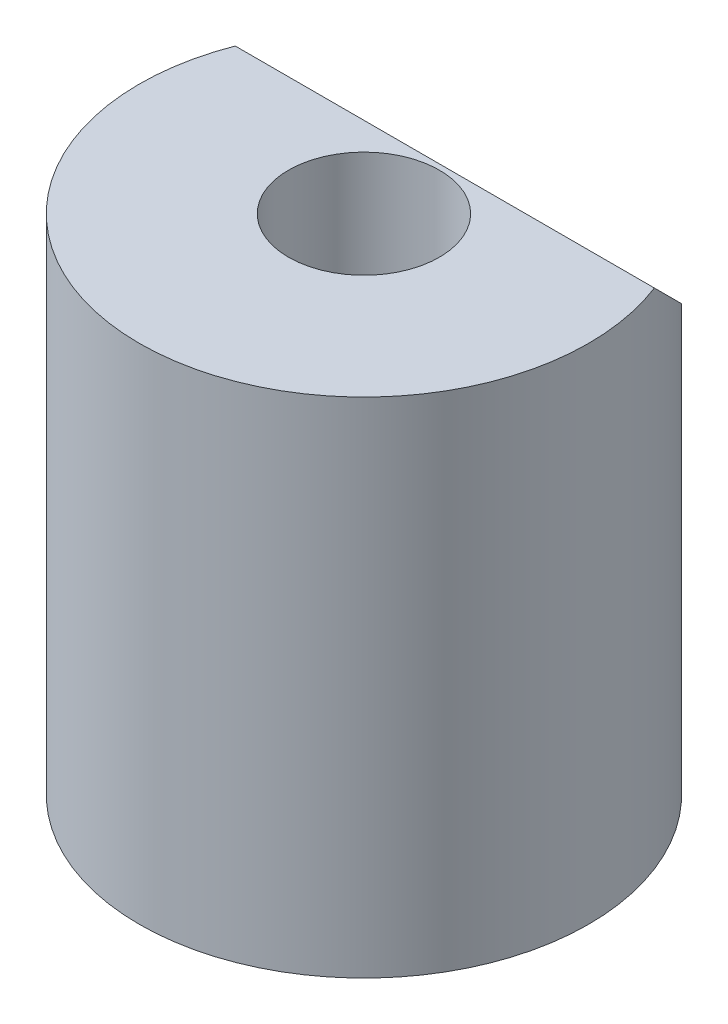
ISO-10303-21;
HEADER;
FILE_DESCRIPTION(('STEP AP214'),'2;1');
FILE_NAME('part.step','',(''),(''),'','','');
FILE_SCHEMA(('AUTOMOTIVE_DESIGN { 1 0 10303 214 1 1 1 1 }'));
ENDSEC;
DATA;
#1=APPLICATION_CONTEXT('core data for automotive mechanical design processes');
#2=APPLICATION_PROTOCOL_DEFINITION('international standard','automotive_design',2000,#1);
#3=PRODUCT_CONTEXT('',#1,'mechanical');
#4=PRODUCT('Part','Part','',(#3));
#5=PRODUCT_RELATED_PRODUCT_CATEGORY('part','',(#4));
#6=PRODUCT_DEFINITION_FORMATION('','',#4);
#7=PRODUCT_DEFINITION_CONTEXT('part definition',#1,'design');
#8=PRODUCT_DEFINITION('design','',#6,#7);
#9=PRODUCT_DEFINITION_SHAPE('','',#8);
#10=(LENGTH_UNIT() NAMED_UNIT(*) SI_UNIT(.MILLI.,.METRE.));
#11=(NAMED_UNIT(*) PLANE_ANGLE_UNIT() SI_UNIT($,.RADIAN.));
#12=(NAMED_UNIT(*) SI_UNIT($,.STERADIAN.) SOLID_ANGLE_UNIT());
#13=UNCERTAINTY_MEASURE_WITH_UNIT(LENGTH_MEASURE(1.E-05),#10,'distance_accuracy_value','');
#14=(GEOMETRIC_REPRESENTATION_CONTEXT(3) GLOBAL_UNCERTAINTY_ASSIGNED_CONTEXT((#13)) GLOBAL_UNIT_ASSIGNED_CONTEXT((#10,
#11,#12)) REPRESENTATION_CONTEXT('',''));
#15=CARTESIAN_POINT('',(0.,0.,0.));
#16=DIRECTION('',(0.,0.,1.));
#17=DIRECTION('',(1.,0.,0.));
#18=AXIS2_PLACEMENT_3D('',#15,#16,#17);
#19=CARTESIAN_POINT('',(0.,14.,0.));
#20=DIRECTION('',(0.,-1.,0.));
#21=DIRECTION('',(0.,0.,-1.));
#22=AXIS2_PLACEMENT_3D('',#19,#20,#21);
#23=CYLINDRICAL_SURFACE('',#22,6.25);
#24=CARTESIAN_POINT('',(0.,16.25,0.));
#25=DIRECTION('',(0.,-0.707106781186551,0.707106781186543));
#26=DIRECTION('',(0.,-0.707106781186544,-0.707106781186551));
#27=AXIS2_PLACEMENT_3D('',#24,#25,#26);
#28=ELLIPSE('',#27,8.8388347648318,6.25);
#29=CARTESIAN_POINT('',(-5.83095189484528,14.,-2.25));
#30=VERTEX_POINT('',#29);
#31=CARTESIAN_POINT('',(5.83095189484531,14.,-2.25));
#32=VERTEX_POINT('',#31);
#33=EDGE_CURVE('E51',#30,#32,#28,.T.);
#34=ORIENTED_EDGE('',*,*,#33,.T.);
#35=CARTESIAN_POINT('',(0.,14.,0.));
#36=DIRECTION('',(0.,1.,0.));
#37=DIRECTION('',(0.,0.,1.));
#38=AXIS2_PLACEMENT_3D('',#35,#36,#37);
#39=CIRCLE('',#38,6.25);
#40=EDGE_CURVE('E46',#30,#32,#39,.T.);
#41=ORIENTED_EDGE('',*,*,#40,.F.);
#42=EDGE_LOOP('',(#34,#41));
#43=FACE_BOUND('',#42,.T.);
#44=CARTESIAN_POINT('',(0.,0.,0.));
#45=DIRECTION('',(0.,1.,0.));
#46=DIRECTION('',(0.,0.,1.));
#47=AXIS2_PLACEMENT_3D('',#44,#45,#46);
#48=CIRCLE('',#47,6.25);
#49=CARTESIAN_POINT('',(0.,0.,6.25));
#50=VERTEX_POINT('',#49);
#51=EDGE_CURVE('E65',#50,#50,#48,.T.);
#52=ORIENTED_EDGE('',*,*,#51,.T.);
#53=EDGE_LOOP('',(#52));
#54=FACE_BOUND('',#53,.T.);
#55=ADVANCED_FACE('F38',(#43,#54),#23,.T.);
#56=CARTESIAN_POINT('',(0.,14.,0.));
#57=DIRECTION('',(0.,1.,0.));
#58=DIRECTION('',(0.,0.,1.));
#59=AXIS2_PLACEMENT_3D('',#56,#57,#58);
#60=PLANE('',#59);
#61=DIRECTION('',(1.,0.,0.));
#62=VECTOR('',#61,1.);
#63=CARTESIAN_POINT('',(0.,14.,-2.25000000000003));
#64=LINE('',#63,#62);
#65=EDGE_CURVE('E11',#30,#32,#64,.T.);
#66=ORIENTED_EDGE('',*,*,#65,.F.);
#67=ORIENTED_EDGE('',*,*,#40,.T.);
#68=EDGE_LOOP('',(#66,#67));
#69=FACE_BOUND('',#68,.T.);
#70=CARTESIAN_POINT('',(0.,14.,0.));
#71=DIRECTION('',(0.,1.,0.));
#72=DIRECTION('',(0.,0.,1.));
#73=AXIS2_PLACEMENT_3D('',#70,#71,#72);
#74=CIRCLE('',#73,2.1);
#75=CARTESIAN_POINT('',(0.,14.,2.1));
#76=VERTEX_POINT('',#75);
#77=EDGE_CURVE('E58',#76,#76,#74,.T.);
#78=ORIENTED_EDGE('',*,*,#77,.F.);
#79=EDGE_LOOP('',(#78));
#80=FACE_BOUND('',#79,.T.);
#81=ADVANCED_FACE('F62',(#69,#80),#60,.T.);
#82=CARTESIAN_POINT('',(0.,0.,0.));
#83=DIRECTION('',(0.,1.,0.));
#84=DIRECTION('',(0.,0.,1.));
#85=AXIS2_PLACEMENT_3D('',#82,#83,#84);
#86=PLANE('',#85);
#87=ORIENTED_EDGE('',*,*,#51,.F.);
#88=EDGE_LOOP('',(#87));
#89=FACE_BOUND('',#88,.T.);
#90=ADVANCED_FACE('F85',(#89),#86,.F.);
#91=CARTESIAN_POINT('',(0.,1.99999999999999,0.));
#92=DIRECTION('',(0.,1.,0.));
#93=DIRECTION('',(0.,0.,1.));
#94=AXIS2_PLACEMENT_3D('',#91,#92,#93);
#95=CYLINDRICAL_SURFACE('',#94,2.1);
#96=CARTESIAN_POINT('',(0.,1.99999999999999,0.));
#97=DIRECTION('',(0.,1.,0.));
#98=DIRECTION('',(0.,0.,1.));
#99=AXIS2_PLACEMENT_3D('',#96,#97,#98);
#100=CIRCLE('',#99,2.1);
#101=CARTESIAN_POINT('',(0.,1.99999999999999,2.09999999999997));
#102=VERTEX_POINT('',#101);
#103=EDGE_CURVE('E70',#102,#102,#100,.T.);
#104=ORIENTED_EDGE('',*,*,#103,.F.);
#105=EDGE_LOOP('',(#104));
#106=FACE_BOUND('',#105,.T.);
#107=ORIENTED_EDGE('',*,*,#77,.T.);
#108=EDGE_LOOP('',(#107));
#109=FACE_BOUND('',#108,.T.);
#110=ADVANCED_FACE('F82',(#106,#109),#95,.F.);
#111=CARTESIAN_POINT('',(0.,1.99999999999999,0.));
#112=DIRECTION('',(0.,1.,0.));
#113=DIRECTION('',(0.,0.,1.));
#114=AXIS2_PLACEMENT_3D('',#111,#112,#113);
#115=PLANE('',#114);
#116=ORIENTED_EDGE('',*,*,#103,.T.);
#117=EDGE_LOOP('',(#116));
#118=FACE_BOUND('',#117,.T.);
#119=ADVANCED_FACE('F80',(#118),#115,.T.);
#120=CARTESIAN_POINT('',(-7.00000000000001,14.,-2.25000000000003));
#121=DIRECTION('',(0.,-0.707106781186551,0.707106781186543));
#122=DIRECTION('',(0.,-0.707106781186544,-0.707106781186551));
#123=AXIS2_PLACEMENT_3D('',#120,#121,#122);
#124=PLANE('',#123);
#125=ORIENTED_EDGE('',*,*,#33,.F.);
#126=ORIENTED_EDGE('',*,*,#65,.T.);
#127=EDGE_LOOP('',(#125,#126));
#128=FACE_BOUND('',#127,.T.);
#129=ADVANCED_FACE('F60',(#128),#124,.F.);
#130=CLOSED_SHELL('',(#55,#81,#90,#110,#119,#129));
#131=MANIFOLD_SOLID_BREP('B2',#130);
#132=ADVANCED_BREP_SHAPE_REPRESENTATION('',(#18,#131),#14);
#133=SHAPE_DEFINITION_REPRESENTATION(#9,#132);
ENDSEC;
END-ISO-10303-21;
